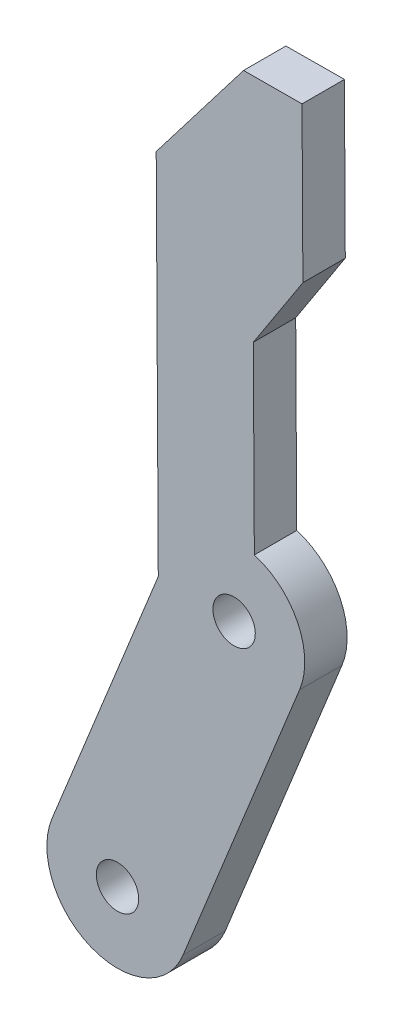
ISO-10303-21;
HEADER;
FILE_DESCRIPTION(('STEP AP214'),'2;1');
FILE_NAME('part.step','',(''),(''),'','','');
FILE_SCHEMA(('AUTOMOTIVE_DESIGN { 1 0 10303 214 1 1 1 1 }'));
ENDSEC;
DATA;
#1=APPLICATION_CONTEXT('core data for automotive mechanical design processes');
#2=APPLICATION_PROTOCOL_DEFINITION('international standard','automotive_design',2000,#1);
#3=PRODUCT_CONTEXT('',#1,'mechanical');
#4=PRODUCT('Part','Part','',(#3));
#5=PRODUCT_RELATED_PRODUCT_CATEGORY('part','',(#4));
#6=PRODUCT_DEFINITION_FORMATION('','',#4);
#7=PRODUCT_DEFINITION_CONTEXT('part definition',#1,'design');
#8=PRODUCT_DEFINITION('design','',#6,#7);
#9=PRODUCT_DEFINITION_SHAPE('','',#8);
#10=(LENGTH_UNIT() NAMED_UNIT(*) SI_UNIT(.MILLI.,.METRE.));
#11=(NAMED_UNIT(*) PLANE_ANGLE_UNIT() SI_UNIT($,.RADIAN.));
#12=(NAMED_UNIT(*) SI_UNIT($,.STERADIAN.) SOLID_ANGLE_UNIT());
#13=UNCERTAINTY_MEASURE_WITH_UNIT(LENGTH_MEASURE(1.E-05),#10,'distance_accuracy_value','');
#14=(GEOMETRIC_REPRESENTATION_CONTEXT(3) GLOBAL_UNCERTAINTY_ASSIGNED_CONTEXT((#13)) GLOBAL_UNIT_ASSIGNED_CONTEXT((#10,
#11,#12)) REPRESENTATION_CONTEXT('',''));
#15=CARTESIAN_POINT('',(0.,0.,0.));
#16=DIRECTION('',(0.,0.,1.));
#17=DIRECTION('',(1.,0.,0.));
#18=AXIS2_PLACEMENT_3D('',#15,#16,#17);
#19=CARTESIAN_POINT('',(-30.71029346049,63.383544152498,0.));
#20=DIRECTION('',(0.,0.,1.));
#21=DIRECTION('',(0.375044776060288,0.92700669682041,0.));
#22=AXIS2_PLACEMENT_3D('',#19,#20,#21);
#23=CYLINDRICAL_SURFACE('',#22,1.5);
#24=CARTESIAN_POINT('',(-30.71029346049,63.383544152498,3.));
#25=DIRECTION('',(0.,0.,-1.));
#26=DIRECTION('',(0.375044776060288,0.92700669682041,0.));
#27=AXIS2_PLACEMENT_3D('',#24,#25,#26);
#28=CIRCLE('',#27,1.5);
#29=CARTESIAN_POINT('',(-31.2728606245804,61.9930341072674,3.));
#30=VERTEX_POINT('',#29);
#31=EDGE_CURVE('E40',#30,#30,#28,.T.);
#32=ORIENTED_EDGE('',*,*,#31,.F.);
#33=DIRECTION('',(0.,0.,-1.));
#34=VECTOR('',#33,1.);
#35=CARTESIAN_POINT('',(-31.2728606245804,61.9930341072674,0.));
#36=LINE('',#35,#34);
#37=CARTESIAN_POINT('',(-31.2728606245804,61.9930341072674,0.));
#38=VERTEX_POINT('',#37);
#39=EDGE_CURVE('E11',#30,#38,#36,.T.);
#40=ORIENTED_EDGE('',*,*,#39,.T.);
#41=CARTESIAN_POINT('',(-30.71029346049,63.383544152498,0.));
#42=DIRECTION('',(0.,0.,-1.));
#43=DIRECTION('',(0.375044776060288,0.92700669682041,0.));
#44=AXIS2_PLACEMENT_3D('',#41,#42,#43);
#45=CIRCLE('',#44,1.5);
#46=EDGE_CURVE('E46',#38,#38,#45,.T.);
#47=ORIENTED_EDGE('',*,*,#46,.T.);
#48=ORIENTED_EDGE('',*,*,#39,.F.);
#49=EDGE_LOOP('',(#32,#40,#47,#48));
#50=FACE_BOUND('',#49,.T.);
#51=ADVANCED_FACE('F36',(#50),#23,.F.);
#52=CARTESIAN_POINT('',(-22.4593083871637,83.777691482547,0.));
#53=DIRECTION('',(0.,0.,1.));
#54=DIRECTION('',(0.375044776060288,0.92700669682041,0.));
#55=AXIS2_PLACEMENT_3D('',#52,#53,#54);
#56=CYLINDRICAL_SURFACE('',#55,1.5);
#57=CARTESIAN_POINT('',(-22.4593083871637,83.777691482547,3.));
#58=DIRECTION('',(0.,0.,-1.));
#59=DIRECTION('',(0.375044776060288,0.92700669682041,0.));
#60=AXIS2_PLACEMENT_3D('',#57,#58,#59);
#61=CIRCLE('',#60,1.5);
#62=CARTESIAN_POINT('',(-23.0218755512541,82.3871814373164,3.));
#63=VERTEX_POINT('',#62);
#64=EDGE_CURVE('E213',#63,#63,#61,.T.);
#65=ORIENTED_EDGE('',*,*,#64,.F.);
#66=DIRECTION('',(0.,0.,-1.));
#67=VECTOR('',#66,1.);
#68=CARTESIAN_POINT('',(-23.0218755512541,82.3871814373164,0.));
#69=LINE('',#68,#67);
#70=CARTESIAN_POINT('',(-23.0218755512541,82.3871814373164,0.));
#71=VERTEX_POINT('',#70);
#72=EDGE_CURVE('E167',#63,#71,#69,.T.);
#73=ORIENTED_EDGE('',*,*,#72,.T.);
#74=CARTESIAN_POINT('',(-22.4593083871637,83.777691482547,0.));
#75=DIRECTION('',(0.,0.,-1.));
#76=DIRECTION('',(0.375044776060288,0.92700669682041,0.));
#77=AXIS2_PLACEMENT_3D('',#74,#75,#76);
#78=CIRCLE('',#77,1.5);
#79=EDGE_CURVE('E164',#71,#71,#78,.T.);
#80=ORIENTED_EDGE('',*,*,#79,.T.);
#81=ORIENTED_EDGE('',*,*,#72,.F.);
#82=EDGE_LOOP('',(#65,#73,#80,#81));
#83=FACE_BOUND('',#82,.T.);
#84=ADVANCED_FACE('F263',(#83),#56,.F.);
#85=CARTESIAN_POINT('',(-21.7925064821957,117.879795703907,0.));
#86=DIRECTION('',(-0.793469040105591,0.60861061639928,0.));
#87=DIRECTION('',(0.,0.,-1.));
#88=AXIS2_PLACEMENT_3D('',#85,#86,#87);
#89=PLANE('',#88);
#90=DIRECTION('',(0.60861061639928,0.793469040105591,0.));
#91=VECTOR('',#90,1.);
#92=CARTESIAN_POINT('',(-27.9720929378929,109.823231455552,0.));
#93=LINE('',#92,#91);
#94=CARTESIAN_POINT('',(-27.9720929378929,109.823231455552,0.));
#95=VERTEX_POINT('',#94);
#96=CARTESIAN_POINT('',(-21.7925064821957,117.879795703907,0.));
#97=VERTEX_POINT('',#96);
#98=EDGE_CURVE('E128',#95,#97,#93,.T.);
#99=ORIENTED_EDGE('',*,*,#98,.F.);
#100=DIRECTION('',(0.,0.,1.));
#101=VECTOR('',#100,1.);
#102=CARTESIAN_POINT('',(-27.9720929378929,109.823231455552,0.));
#103=LINE('',#102,#101);
#104=CARTESIAN_POINT('',(-27.9720929378929,109.823231455552,3.));
#105=VERTEX_POINT('',#104);
#106=EDGE_CURVE('E143',#95,#105,#103,.T.);
#107=ORIENTED_EDGE('',*,*,#106,.T.);
#108=DIRECTION('',(-0.60861061639928,-0.793469040105591,0.));
#109=VECTOR('',#108,1.);
#110=CARTESIAN_POINT('',(-27.9720929378929,109.823231455552,3.));
#111=LINE('',#110,#109);
#112=CARTESIAN_POINT('',(-21.7925064821957,117.879795703907,3.));
#113=VERTEX_POINT('',#112);
#114=EDGE_CURVE('E122',#113,#105,#111,.T.);
#115=ORIENTED_EDGE('',*,*,#114,.F.);
#116=DIRECTION('',(0.,0.,1.));
#117=VECTOR('',#116,1.);
#118=CARTESIAN_POINT('',(-21.7925064821957,117.879795703907,0.));
#119=LINE('',#118,#117);
#120=EDGE_CURVE('E139',#97,#113,#119,.T.);
#121=ORIENTED_EDGE('',*,*,#120,.F.);
#122=EDGE_LOOP('',(#99,#107,#115,#121));
#123=FACE_BOUND('',#122,.T.);
#124=ADVANCED_FACE('F140',(#123),#89,.T.);
#125=CARTESIAN_POINT('',(-17.6515624176446,117.903134361591,0.));
#126=DIRECTION('',(-0.00563598219370531,0.999984117726233,0.));
#127=DIRECTION('',(0.,0.,-1.));
#128=AXIS2_PLACEMENT_3D('',#125,#126,#127);
#129=PLANE('',#128);
#130=DIRECTION('',(0.999984117726233,0.00563598219370531,0.));
#131=VECTOR('',#130,1.);
#132=CARTESIAN_POINT('',(-28.0173025791693,117.844712306741,0.));
#133=LINE('',#132,#131);
#134=CARTESIAN_POINT('',(-17.6515624176446,117.903134361591,0.));
#135=VERTEX_POINT('',#134);
#136=EDGE_CURVE('E132',#97,#135,#133,.T.);
#137=ORIENTED_EDGE('',*,*,#136,.F.);
#138=ORIENTED_EDGE('',*,*,#120,.T.);
#139=DIRECTION('',(-0.999984117726233,-0.00563598219370531,0.));
#140=VECTOR('',#139,1.);
#141=CARTESIAN_POINT('',(-28.0173025791693,117.844712306741,3.));
#142=LINE('',#141,#140);
#143=CARTESIAN_POINT('',(-17.6515624176446,117.903134361591,3.));
#144=VERTEX_POINT('',#143);
#145=EDGE_CURVE('E205',#144,#113,#142,.T.);
#146=ORIENTED_EDGE('',*,*,#145,.F.);
#147=DIRECTION('',(0.,0.,1.));
#148=VECTOR('',#147,1.);
#149=CARTESIAN_POINT('',(-17.6515624176446,117.903134361591,0.));
#150=LINE('',#149,#148);
#151=EDGE_CURVE('E144',#135,#144,#150,.T.);
#152=ORIENTED_EDGE('',*,*,#151,.F.);
#153=EDGE_LOOP('',(#137,#138,#146,#152));
#154=FACE_BOUND('',#153,.T.);
#155=ADVANCED_FACE('F146',(#154),#129,.T.);
#156=CARTESIAN_POINT('',(-17.5899666930683,106.97429459965,0.));
#157=DIRECTION('',(0.999984117726233,0.00563598219370531,0.));
#158=DIRECTION('',(0.,0.,-1.));
#159=AXIS2_PLACEMENT_3D('',#156,#157,#158);
#160=PLANE('',#159);
#161=DIRECTION('',(0.00563598219370531,-0.999984117726233,0.));
#162=VECTOR('',#161,1.);
#163=CARTESIAN_POINT('',(-17.6515624176446,117.903134361591,0.));
#164=LINE('',#163,#162);
#165=CARTESIAN_POINT('',(-17.5899666930683,106.97429459965,0.));
#166=VERTEX_POINT('',#165);
#167=EDGE_CURVE('E149',#135,#166,#164,.T.);
#168=ORIENTED_EDGE('',*,*,#167,.F.);
#169=ORIENTED_EDGE('',*,*,#151,.T.);
#170=DIRECTION('',(-0.00563598219370531,0.999984117726233,0.));
#171=VECTOR('',#170,1.);
#172=CARTESIAN_POINT('',(-17.6515624176446,117.903134361591,3.));
#173=LINE('',#172,#171);
#174=CARTESIAN_POINT('',(-17.5899666930683,106.97429459965,3.));
#175=VERTEX_POINT('',#174);
#176=EDGE_CURVE('E201',#175,#144,#173,.T.);
#177=ORIENTED_EDGE('',*,*,#176,.F.);
#178=DIRECTION('',(0.,0.,1.));
#179=VECTOR('',#178,1.);
#180=CARTESIAN_POINT('',(-17.5899666930683,106.97429459965,0.));
#181=LINE('',#180,#179);
#182=EDGE_CURVE('E192',#166,#175,#181,.T.);
#183=ORIENTED_EDGE('',*,*,#182,.F.);
#184=EDGE_LOOP('',(#168,#169,#177,#183));
#185=FACE_BOUND('',#184,.T.);
#186=ADVANCED_FACE('F251',(#185),#160,.T.);
#187=CARTESIAN_POINT('',(-21.099727818248,101.567782043644,0.));
#188=DIRECTION('',(0.838760494799222,-0.544500534769402,0.));
#189=DIRECTION('',(-0.544500534769402,-0.838760494799222,0.));
#190=AXIS2_PLACEMENT_3D('',#187,#188,#189);
#191=PLANE('',#190);
#192=DIRECTION('',(0.544500534769402,0.838760494799222,0.));
#193=VECTOR('',#192,1.);
#194=CARTESIAN_POINT('',(-21.099727818248,101.567782043644,0.));
#195=LINE('',#194,#193);
#196=CARTESIAN_POINT('',(-21.099727818248,101.567782043644,0.));
#197=VERTEX_POINT('',#196);
#198=EDGE_CURVE('E190',#197,#166,#195,.T.);
#199=ORIENTED_EDGE('',*,*,#198,.T.);
#200=ORIENTED_EDGE('',*,*,#182,.T.);
#201=DIRECTION('',(0.544500534769402,0.838760494799222,0.));
#202=VECTOR('',#201,1.);
#203=CARTESIAN_POINT('',(-21.099727818248,101.567782043644,3.));
#204=LINE('',#203,#202);
#205=CARTESIAN_POINT('',(-21.099727818248,101.567782043644,3.));
#206=VERTEX_POINT('',#205);
#207=EDGE_CURVE('E204',#206,#175,#204,.T.);
#208=ORIENTED_EDGE('',*,*,#207,.F.);
#209=DIRECTION('',(0.,0.,1.));
#210=VECTOR('',#209,1.);
#211=CARTESIAN_POINT('',(-21.099727818248,101.567782043644,0.));
#212=LINE('',#211,#210);
#213=EDGE_CURVE('E200',#197,#206,#212,.T.);
#214=ORIENTED_EDGE('',*,*,#213,.F.);
#215=EDGE_LOOP('',(#199,#200,#208,#214));
#216=FACE_BOUND('',#215,.T.);
#217=ADVANCED_FACE('F243',(#216),#191,.T.);
#218=CARTESIAN_POINT('',(-21.0264600497298,88.5679885132032,0.));
#219=DIRECTION('',(0.999984117726233,0.00563598219370576,0.));
#220=DIRECTION('',(0.,0.,-1.));
#221=AXIS2_PLACEMENT_3D('',#218,#219,#220);
#222=PLANE('',#221);
#223=DIRECTION('',(0.00563598219370531,-0.999984117726233,0.));
#224=VECTOR('',#223,1.);
#225=CARTESIAN_POINT('',(-21.099727818248,101.567782043644,0.));
#226=LINE('',#225,#224);
#227=CARTESIAN_POINT('',(-21.0264600497298,88.5679885132032,0.));
#228=VERTEX_POINT('',#227);
#229=EDGE_CURVE('E151',#197,#228,#226,.T.);
#230=ORIENTED_EDGE('',*,*,#229,.F.);
#231=ORIENTED_EDGE('',*,*,#213,.T.);
#232=DIRECTION('',(-0.00563598219370531,0.999984117726233,0.));
#233=VECTOR('',#232,1.);
#234=CARTESIAN_POINT('',(-21.099727818248,101.567782043644,3.));
#235=LINE('',#234,#233);
#236=CARTESIAN_POINT('',(-21.0264600497298,88.5679885132032,3.));
#237=VERTEX_POINT('',#236);
#238=EDGE_CURVE('E214',#237,#206,#235,.T.);
#239=ORIENTED_EDGE('',*,*,#238,.F.);
#240=DIRECTION('',(0.,0.,1.));
#241=VECTOR('',#240,1.);
#242=CARTESIAN_POINT('',(-21.0264600497298,88.5679885132032,0.));
#243=LINE('',#242,#241);
#244=EDGE_CURVE('E197',#228,#237,#243,.T.);
#245=ORIENTED_EDGE('',*,*,#244,.F.);
#246=EDGE_LOOP('',(#230,#231,#239,#245));
#247=FACE_BOUND('',#246,.T.);
#248=ADVANCED_FACE('F248',(#247),#222,.T.);
#249=CARTESIAN_POINT('',(-22.4593083871637,83.777691482547,0.));
#250=DIRECTION('',(0.,0.,1.));
#251=DIRECTION('',(0.92700669682041,-0.375044776060288,0.));
#252=AXIS2_PLACEMENT_3D('',#249,#250,#251);
#253=CYLINDRICAL_SURFACE('',#252,5.);
#254=CARTESIAN_POINT('',(-22.4593083871637,83.777691482547,0.));
#255=DIRECTION('',(0.,0.,1.));
#256=DIRECTION('',(0.92700669682041,-0.375044776060288,0.));
#257=AXIS2_PLACEMENT_3D('',#254,#255,#256);
#258=CIRCLE('',#257,5.);
#259=CARTESIAN_POINT('',(-17.8242749030616,81.9024676022456,0.));
#260=VERTEX_POINT('',#259);
#261=EDGE_CURVE('E207',#260,#228,#258,.T.);
#262=ORIENTED_EDGE('',*,*,#261,.T.);
#263=ORIENTED_EDGE('',*,*,#244,.T.);
#264=CARTESIAN_POINT('',(-22.4593083871637,83.777691482547,3.));
#265=DIRECTION('',(0.,0.,1.));
#266=DIRECTION('',(0.92700669682041,-0.375044776060288,0.));
#267=AXIS2_PLACEMENT_3D('',#264,#265,#266);
#268=CIRCLE('',#267,5.);
#269=CARTESIAN_POINT('',(-17.8242749030616,81.9024676022456,3.));
#270=VERTEX_POINT('',#269);
#271=EDGE_CURVE('E109',#270,#237,#268,.T.);
#272=ORIENTED_EDGE('',*,*,#271,.F.);
#273=DIRECTION('',(0.,0.,1.));
#274=VECTOR('',#273,1.);
#275=CARTESIAN_POINT('',(-17.8242749030616,81.9024676022456,0.));
#276=LINE('',#275,#274);
#277=EDGE_CURVE('E113',#260,#270,#276,.T.);
#278=ORIENTED_EDGE('',*,*,#277,.F.);
#279=EDGE_LOOP('',(#262,#263,#272,#278));
#280=FACE_BOUND('',#279,.T.);
#281=ADVANCED_FACE('F273',(#280),#253,.T.);
#282=CARTESIAN_POINT('',(-26.0752599763879,61.5083202721966,0.));
#283=DIRECTION('',(0.92700669682041,-0.375044776060288,0.));
#284=DIRECTION('',(0.,0.,-1.));
#285=AXIS2_PLACEMENT_3D('',#282,#283,#284);
#286=PLANE('',#285);
#287=DIRECTION('',(0.375044776060288,0.92700669682041,0.));
#288=VECTOR('',#287,1.);
#289=CARTESIAN_POINT('',(-26.0752599763879,61.5083202721966,0.));
#290=LINE('',#289,#288);
#291=CARTESIAN_POINT('',(-26.0752599763879,61.5083202721966,0.));
#292=VERTEX_POINT('',#291);
#293=EDGE_CURVE('E194',#292,#260,#290,.T.);
#294=ORIENTED_EDGE('',*,*,#293,.T.);
#295=ORIENTED_EDGE('',*,*,#277,.T.);
#296=DIRECTION('',(0.375044776060288,0.92700669682041,0.));
#297=VECTOR('',#296,1.);
#298=CARTESIAN_POINT('',(-26.0752599763879,61.5083202721966,3.));
#299=LINE('',#298,#297);
#300=CARTESIAN_POINT('',(-26.0752599763879,61.5083202721966,3.));
#301=VERTEX_POINT('',#300);
#302=EDGE_CURVE('E210',#301,#270,#299,.T.);
#303=ORIENTED_EDGE('',*,*,#302,.F.);
#304=DIRECTION('',(0.,0.,1.));
#305=VECTOR('',#304,1.);
#306=CARTESIAN_POINT('',(-26.0752599763879,61.5083202721966,0.));
#307=LINE('',#306,#305);
#308=EDGE_CURVE('E159',#292,#301,#307,.T.);
#309=ORIENTED_EDGE('',*,*,#308,.F.);
#310=EDGE_LOOP('',(#294,#295,#303,#309));
#311=FACE_BOUND('',#310,.T.);
#312=ADVANCED_FACE('F312',(#311),#286,.T.);
#313=CARTESIAN_POINT('',(-30.71029346049,63.383544152498,0.));
#314=DIRECTION('',(0.,0.,1.));
#315=DIRECTION('',(-0.92700669682041,0.375044776060288,0.));
#316=AXIS2_PLACEMENT_3D('',#313,#314,#315);
#317=CYLINDRICAL_SURFACE('',#316,5.);
#318=CARTESIAN_POINT('',(-30.71029346049,63.383544152498,0.));
#319=DIRECTION('',(0.,0.,1.));
#320=DIRECTION('',(-0.92700669682041,0.375044776060288,0.));
#321=AXIS2_PLACEMENT_3D('',#318,#319,#320);
#322=CIRCLE('',#321,5.);
#323=CARTESIAN_POINT('',(-35.3453269445921,65.2587680327994,0.));
#324=VERTEX_POINT('',#323);
#325=EDGE_CURVE('E156',#324,#292,#322,.T.);
#326=ORIENTED_EDGE('',*,*,#325,.T.);
#327=ORIENTED_EDGE('',*,*,#308,.T.);
#328=CARTESIAN_POINT('',(-30.71029346049,63.383544152498,3.));
#329=DIRECTION('',(0.,0.,1.));
#330=DIRECTION('',(-0.92700669682041,0.375044776060288,0.));
#331=AXIS2_PLACEMENT_3D('',#328,#329,#330);
#332=CIRCLE('',#331,5.);
#333=CARTESIAN_POINT('',(-35.3453269445921,65.2587680327994,3.));
#334=VERTEX_POINT('',#333);
#335=EDGE_CURVE('E163',#334,#301,#332,.T.);
#336=ORIENTED_EDGE('',*,*,#335,.F.);
#337=DIRECTION('',(0.,0.,1.));
#338=VECTOR('',#337,1.);
#339=CARTESIAN_POINT('',(-35.3453269445921,65.2587680327994,0.));
#340=LINE('',#339,#338);
#341=EDGE_CURVE('E174',#324,#334,#340,.T.);
#342=ORIENTED_EDGE('',*,*,#341,.F.);
#343=EDGE_LOOP('',(#326,#327,#336,#342));
#344=FACE_BOUND('',#343,.T.);
#345=ADVANCED_FACE('F38',(#344),#317,.T.);
#346=CARTESIAN_POINT('',(-27.8256791845833,83.8452523040487,0.));
#347=DIRECTION('',(-0.92700669682041,0.375044776060288,0.));
#348=DIRECTION('',(0.375044776060288,0.92700669682041,0.));
#349=AXIS2_PLACEMENT_3D('',#346,#347,#348);
#350=PLANE('',#349);
#351=DIRECTION('',(-0.375044776060288,-0.92700669682041,0.));
#352=VECTOR('',#351,1.);
#353=CARTESIAN_POINT('',(-27.0943418712657,85.6529153628485,0.));
#354=LINE('',#353,#352);
#355=CARTESIAN_POINT('',(-27.8256791845833,83.8452523040487,0.));
#356=VERTEX_POINT('',#355);
#357=EDGE_CURVE('E176',#356,#324,#354,.T.);
#358=ORIENTED_EDGE('',*,*,#357,.T.);
#359=ORIENTED_EDGE('',*,*,#341,.T.);
#360=DIRECTION('',(-0.375044776060288,-0.92700669682041,0.));
#361=VECTOR('',#360,1.);
#362=CARTESIAN_POINT('',(-27.0943418712657,85.6529153628485,3.));
#363=LINE('',#362,#361);
#364=CARTESIAN_POINT('',(-27.8256791845833,83.8452523040487,3.));
#365=VERTEX_POINT('',#364);
#366=EDGE_CURVE('E160',#365,#334,#363,.T.);
#367=ORIENTED_EDGE('',*,*,#366,.F.);
#368=DIRECTION('',(0.,0.,1.));
#369=VECTOR('',#368,1.);
#370=CARTESIAN_POINT('',(-27.8256791845833,83.8452523040487,0.));
#371=LINE('',#370,#369);
#372=EDGE_CURVE('E181',#356,#365,#371,.T.);
#373=ORIENTED_EDGE('',*,*,#372,.F.);
#374=EDGE_LOOP('',(#358,#359,#367,#373));
#375=FACE_BOUND('',#374,.T.);
#376=ADVANCED_FACE('F232',(#375),#350,.T.);
#377=CARTESIAN_POINT('',(-27.9720929378929,109.823231455552,0.));
#378=DIRECTION('',(-0.999984117726233,-0.00563598219370531,0.));
#379=DIRECTION('',(0.,0.,1.));
#380=AXIS2_PLACEMENT_3D('',#377,#378,#379);
#381=PLANE('',#380);
#382=DIRECTION('',(0.00563598219370531,-0.999984117726233,0.));
#383=VECTOR('',#382,1.);
#384=CARTESIAN_POINT('',(-28.0173025791693,117.844712306741,0.));
#385=LINE('',#384,#383);
#386=EDGE_CURVE('E136',#95,#356,#385,.T.);
#387=ORIENTED_EDGE('',*,*,#386,.T.);
#388=ORIENTED_EDGE('',*,*,#372,.T.);
#389=DIRECTION('',(0.00563598219370531,-0.999984117726233,0.));
#390=VECTOR('',#389,1.);
#391=CARTESIAN_POINT('',(-28.0173025791693,117.844712306741,3.));
#392=LINE('',#391,#390);
#393=EDGE_CURVE('E162',#105,#365,#392,.T.);
#394=ORIENTED_EDGE('',*,*,#393,.F.);
#395=ORIENTED_EDGE('',*,*,#106,.F.);
#396=EDGE_LOOP('',(#387,#388,#394,#395));
#397=FACE_BOUND('',#396,.T.);
#398=ADVANCED_FACE('F230',(#397),#381,.T.);
#399=CARTESIAN_POINT('',(-25.8308868339381,88.6140210846763,3.));
#400=DIRECTION('',(0.,0.,1.));
#401=DIRECTION('',(0.375044776060288,0.92700669682041,0.));
#402=AXIS2_PLACEMENT_3D('',#399,#400,#401);
#403=PLANE('',#402);
#404=ORIENTED_EDGE('',*,*,#393,.T.);
#405=ORIENTED_EDGE('',*,*,#366,.T.);
#406=ORIENTED_EDGE('',*,*,#335,.T.);
#407=ORIENTED_EDGE('',*,*,#302,.T.);
#408=ORIENTED_EDGE('',*,*,#271,.T.);
#409=ORIENTED_EDGE('',*,*,#238,.T.);
#410=ORIENTED_EDGE('',*,*,#207,.T.);
#411=ORIENTED_EDGE('',*,*,#176,.T.);
#412=ORIENTED_EDGE('',*,*,#145,.T.);
#413=ORIENTED_EDGE('',*,*,#114,.T.);
#414=EDGE_LOOP('',(#404,#405,#406,#407,#408,#409,#410,#411,#412,#413));
#415=FACE_BOUND('',#414,.T.);
#416=ORIENTED_EDGE('',*,*,#64,.T.);
#417=EDGE_LOOP('',(#416));
#418=FACE_BOUND('',#417,.T.);
#419=ORIENTED_EDGE('',*,*,#31,.T.);
#420=EDGE_LOOP('',(#419));
#421=FACE_BOUND('',#420,.T.);
#422=ADVANCED_FACE('F228',(#415,#418,#421),#403,.T.);
#423=CARTESIAN_POINT('',(-25.8308868339381,88.6140210846763,0.));
#424=DIRECTION('',(0.,0.,1.));
#425=DIRECTION('',(0.375044776060288,0.92700669682041,0.));
#426=AXIS2_PLACEMENT_3D('',#423,#424,#425);
#427=PLANE('',#426);
#428=ORIENTED_EDGE('',*,*,#386,.F.);
#429=ORIENTED_EDGE('',*,*,#98,.T.);
#430=ORIENTED_EDGE('',*,*,#136,.T.);
#431=ORIENTED_EDGE('',*,*,#167,.T.);
#432=ORIENTED_EDGE('',*,*,#198,.F.);
#433=ORIENTED_EDGE('',*,*,#229,.T.);
#434=ORIENTED_EDGE('',*,*,#261,.F.);
#435=ORIENTED_EDGE('',*,*,#293,.F.);
#436=ORIENTED_EDGE('',*,*,#325,.F.);
#437=ORIENTED_EDGE('',*,*,#357,.F.);
#438=EDGE_LOOP('',(#428,#429,#430,#431,#432,#433,#434,#435,#436,#437));
#439=FACE_BOUND('',#438,.T.);
#440=ORIENTED_EDGE('',*,*,#79,.F.);
#441=EDGE_LOOP('',(#440));
#442=FACE_BOUND('',#441,.T.);
#443=ORIENTED_EDGE('',*,*,#46,.F.);
#444=EDGE_LOOP('',(#443));
#445=FACE_BOUND('',#444,.T.);
#446=ADVANCED_FACE('F129',(#439,#442,#445),#427,.F.);
#447=CLOSED_SHELL('',(#51,#84,#124,#155,#186,#217,#248,#281,#312,#345,#376,#398,#422,#446));
#448=MANIFOLD_SOLID_BREP('B2',#447);
#449=ADVANCED_BREP_SHAPE_REPRESENTATION('',(#18,#448),#14);
#450=SHAPE_DEFINITION_REPRESENTATION(#9,#449);
ENDSEC;
END-ISO-10303-21;
